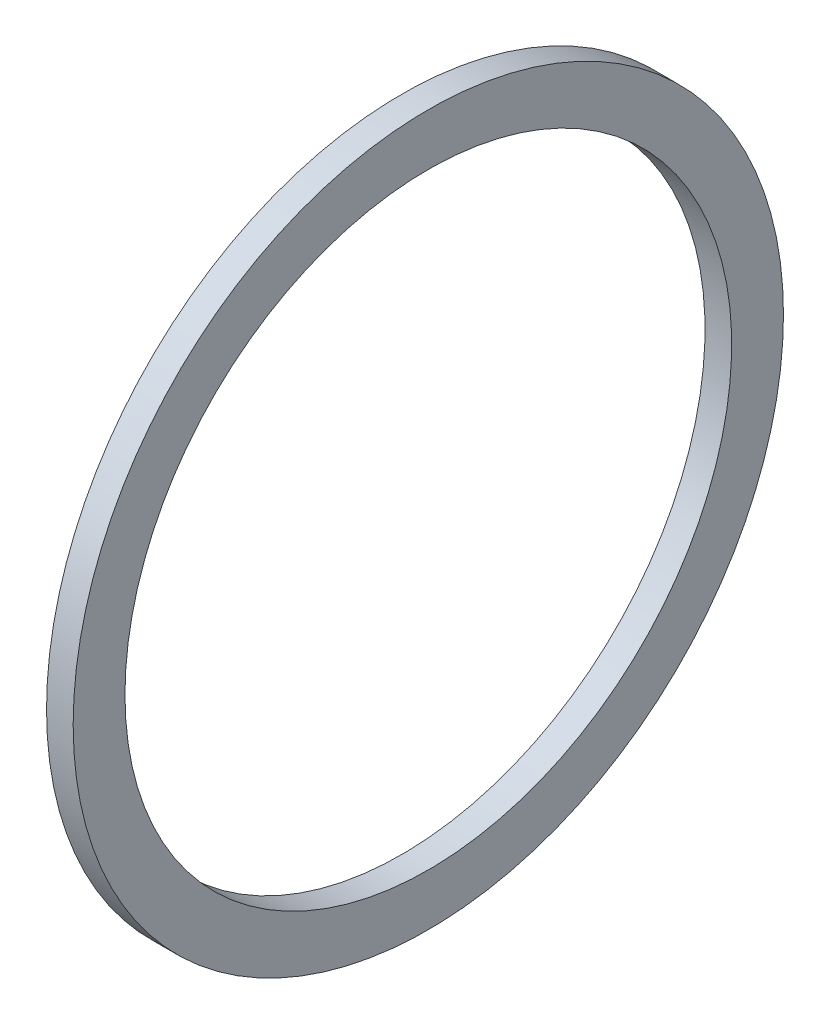
ISO-10303-21;
HEADER;
FILE_DESCRIPTION(('STEP AP214'),'2;1');
FILE_NAME('part.step','',(''),(''),'','','');
FILE_SCHEMA(('AUTOMOTIVE_DESIGN { 1 0 10303 214 1 1 1 1 }'));
ENDSEC;
DATA;
#1=APPLICATION_CONTEXT('core data for automotive mechanical design processes');
#2=APPLICATION_PROTOCOL_DEFINITION('international standard','automotive_design',2000,#1);
#3=PRODUCT_CONTEXT('',#1,'mechanical');
#4=PRODUCT('Part','Part','',(#3));
#5=PRODUCT_RELATED_PRODUCT_CATEGORY('part','',(#4));
#6=PRODUCT_DEFINITION_FORMATION('','',#4);
#7=PRODUCT_DEFINITION_CONTEXT('part definition',#1,'design');
#8=PRODUCT_DEFINITION('design','',#6,#7);
#9=PRODUCT_DEFINITION_SHAPE('','',#8);
#10=(LENGTH_UNIT() NAMED_UNIT(*) SI_UNIT(.MILLI.,.METRE.));
#11=(NAMED_UNIT(*) PLANE_ANGLE_UNIT() SI_UNIT($,.RADIAN.));
#12=(NAMED_UNIT(*) SI_UNIT($,.STERADIAN.) SOLID_ANGLE_UNIT());
#13=UNCERTAINTY_MEASURE_WITH_UNIT(LENGTH_MEASURE(1.E-05),#10,'distance_accuracy_value','');
#14=(GEOMETRIC_REPRESENTATION_CONTEXT(3) GLOBAL_UNCERTAINTY_ASSIGNED_CONTEXT((#13)) GLOBAL_UNIT_ASSIGNED_CONTEXT((#10,
#11,#12)) REPRESENTATION_CONTEXT('',''));
#15=CARTESIAN_POINT('',(0.,0.,0.));
#16=DIRECTION('',(0.,0.,1.));
#17=DIRECTION('',(1.,0.,0.));
#18=AXIS2_PLACEMENT_3D('',#15,#16,#17);
#19=CARTESIAN_POINT('',(4.5,102.5,0.));
#20=DIRECTION('',(-1.,0.,0.));
#21=DIRECTION('',(0.,0.,1.));
#22=AXIS2_PLACEMENT_3D('',#19,#20,#21);
#23=PLANE('',#22);
#24=CARTESIAN_POINT('',(4.5,0.,0.));
#25=DIRECTION('',(-1.,0.,0.));
#26=DIRECTION('',(0.,0.,1.));
#27=AXIS2_PLACEMENT_3D('',#24,#25,#26);
#28=CIRCLE('',#27,120.);
#29=CARTESIAN_POINT('',(4.5,0.,120.));
#30=VERTEX_POINT('',#29);
#31=EDGE_CURVE('E48',#30,#30,#28,.T.);
#32=ORIENTED_EDGE('',*,*,#31,.F.);
#33=EDGE_LOOP('',(#32));
#34=FACE_BOUND('',#33,.T.);
#35=CARTESIAN_POINT('',(4.5,0.,0.));
#36=DIRECTION('',(-1.,0.,0.));
#37=DIRECTION('',(0.,0.,1.));
#38=AXIS2_PLACEMENT_3D('',#35,#36,#37);
#39=CIRCLE('',#38,102.5);
#40=CARTESIAN_POINT('',(4.5,0.,102.5));
#41=VERTEX_POINT('',#40);
#42=EDGE_CURVE('E10',#41,#41,#39,.T.);
#43=ORIENTED_EDGE('',*,*,#42,.T.);
#44=EDGE_LOOP('',(#43));
#45=FACE_BOUND('',#44,.T.);
#46=ADVANCED_FACE('F34',(#34,#45),#23,.F.);
#47=CARTESIAN_POINT('',(0.,0.,0.));
#48=DIRECTION('',(-1.,0.,0.));
#49=DIRECTION('',(0.,0.,1.));
#50=AXIS2_PLACEMENT_3D('',#47,#48,#49);
#51=CYLINDRICAL_SURFACE('',#50,102.5);
#52=ORIENTED_EDGE('',*,*,#42,.F.);
#53=EDGE_LOOP('',(#52));
#54=FACE_BOUND('',#53,.T.);
#55=CARTESIAN_POINT('',(-4.5,0.,0.));
#56=DIRECTION('',(-1.,0.,0.));
#57=DIRECTION('',(0.,0.,1.));
#58=AXIS2_PLACEMENT_3D('',#55,#56,#57);
#59=CIRCLE('',#58,102.5);
#60=CARTESIAN_POINT('',(-4.5,0.,102.5));
#61=VERTEX_POINT('',#60);
#62=EDGE_CURVE('E40',#61,#61,#59,.T.);
#63=ORIENTED_EDGE('',*,*,#62,.T.);
#64=EDGE_LOOP('',(#63));
#65=FACE_BOUND('',#64,.T.);
#66=ADVANCED_FACE('F57',(#54,#65),#51,.F.);
#67=CARTESIAN_POINT('',(-4.5,102.5,0.));
#68=DIRECTION('',(1.,0.,0.));
#69=DIRECTION('',(0.,0.,-1.));
#70=AXIS2_PLACEMENT_3D('',#67,#68,#69);
#71=PLANE('',#70);
#72=ORIENTED_EDGE('',*,*,#62,.F.);
#73=EDGE_LOOP('',(#72));
#74=FACE_BOUND('',#73,.T.);
#75=CARTESIAN_POINT('',(-4.5,0.,0.));
#76=DIRECTION('',(-1.,0.,0.));
#77=DIRECTION('',(0.,0.,1.));
#78=AXIS2_PLACEMENT_3D('',#75,#76,#77);
#79=CIRCLE('',#78,120.);
#80=CARTESIAN_POINT('',(-4.5,0.,120.));
#81=VERTEX_POINT('',#80);
#82=EDGE_CURVE('E44',#81,#81,#79,.T.);
#83=ORIENTED_EDGE('',*,*,#82,.T.);
#84=EDGE_LOOP('',(#83));
#85=FACE_BOUND('',#84,.T.);
#86=ADVANCED_FACE('F61',(#74,#85),#71,.F.);
#87=CARTESIAN_POINT('',(0.,0.,0.));
#88=DIRECTION('',(-1.,0.,0.));
#89=DIRECTION('',(0.,0.,1.));
#90=AXIS2_PLACEMENT_3D('',#87,#88,#89);
#91=CYLINDRICAL_SURFACE('',#90,120.);
#92=ORIENTED_EDGE('',*,*,#82,.F.);
#93=EDGE_LOOP('',(#92));
#94=FACE_BOUND('',#93,.T.);
#95=ORIENTED_EDGE('',*,*,#31,.T.);
#96=EDGE_LOOP('',(#95));
#97=FACE_BOUND('',#96,.T.);
#98=ADVANCED_FACE('F54',(#94,#97),#91,.T.);
#99=CLOSED_SHELL('',(#46,#66,#86,#98));
#100=MANIFOLD_SOLID_BREP('B2',#99);
#101=ADVANCED_BREP_SHAPE_REPRESENTATION('',(#18,#100),#14);
#102=SHAPE_DEFINITION_REPRESENTATION(#9,#101);
ENDSEC;
END-ISO-10303-21;
